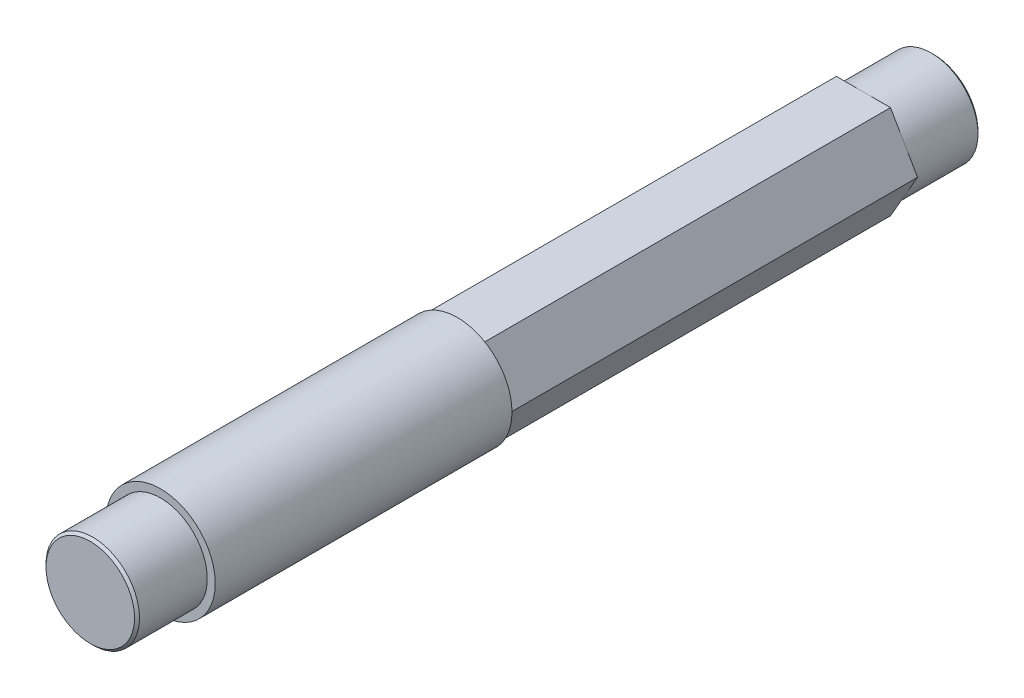
ISO-10303-21;
HEADER;
FILE_DESCRIPTION(('STEP AP214'),'2;1');
FILE_NAME('part.step','',(''),(''),'','','');
FILE_SCHEMA(('AUTOMOTIVE_DESIGN { 1 0 10303 214 1 1 1 1 }'));
ENDSEC;
DATA;
#1=APPLICATION_CONTEXT('core data for automotive mechanical design processes');
#2=APPLICATION_PROTOCOL_DEFINITION('international standard','automotive_design',2000,#1);
#3=PRODUCT_CONTEXT('',#1,'mechanical');
#4=PRODUCT('Part','Part','',(#3));
#5=PRODUCT_RELATED_PRODUCT_CATEGORY('part','',(#4));
#6=PRODUCT_DEFINITION_FORMATION('','',#4);
#7=PRODUCT_DEFINITION_CONTEXT('part definition',#1,'design');
#8=PRODUCT_DEFINITION('design','',#6,#7);
#9=PRODUCT_DEFINITION_SHAPE('','',#8);
#10=(LENGTH_UNIT() NAMED_UNIT(*) SI_UNIT(.MILLI.,.METRE.));
#11=(NAMED_UNIT(*) PLANE_ANGLE_UNIT() SI_UNIT($,.RADIAN.));
#12=(NAMED_UNIT(*) SI_UNIT($,.STERADIAN.) SOLID_ANGLE_UNIT());
#13=UNCERTAINTY_MEASURE_WITH_UNIT(LENGTH_MEASURE(1.E-05),#10,'distance_accuracy_value','');
#14=(GEOMETRIC_REPRESENTATION_CONTEXT(3) GLOBAL_UNCERTAINTY_ASSIGNED_CONTEXT((#13)) GLOBAL_UNIT_ASSIGNED_CONTEXT((#10,
#11,#12)) REPRESENTATION_CONTEXT('',''));
#15=CARTESIAN_POINT('',(0.,0.,0.));
#16=DIRECTION('',(0.,0.,1.));
#17=DIRECTION('',(1.,0.,0.));
#18=AXIS2_PLACEMENT_3D('',#15,#16,#17);
#19=CARTESIAN_POINT('',(0.,0.,-42.8625));
#20=DIRECTION('',(0.,0.,-1.));
#21=DIRECTION('',(-1.,0.,0.));
#22=AXIS2_PLACEMENT_3D('',#19,#20,#21);
#23=PLANE('',#22);
#24=CARTESIAN_POINT('',(0.,0.,-42.8625000000125));
#25=DIRECTION('',(0.,0.,1.));
#26=DIRECTION('',(1.,0.,0.));
#27=AXIS2_PLACEMENT_3D('',#24,#25,#26);
#28=CIRCLE('',#27,4.49980000001915);
#29=CARTESIAN_POINT('',(4.49980000001915,0.,-42.8625000000125));
#30=VERTEX_POINT('',#29);
#31=EDGE_CURVE('E20',#30,#30,#28,.T.);
#32=ORIENTED_EDGE('',*,*,#31,.F.);
#33=EDGE_LOOP('',(#32));
#34=FACE_BOUND('',#33,.T.);
#35=ADVANCED_FACE('F17',(#34),#23,.T.);
#36=CARTESIAN_POINT('',(0.,0.,-42.6125000000752));
#37=DIRECTION('',(0.,0.,1.));
#38=DIRECTION('',(1.,0.,0.));
#39=AXIS2_PLACEMENT_3D('',#36,#37,#38);
#40=CONICAL_SURFACE('',#39,4.74979999995639,0.785398163397448);
#41=CARTESIAN_POINT('',(0.,0.,-42.6125));
#42=DIRECTION('',(0.,0.,1.));
#43=DIRECTION('',(1.,0.,0.));
#44=AXIS2_PLACEMENT_3D('',#41,#42,#43);
#45=CIRCLE('',#44,4.7498);
#46=CARTESIAN_POINT('',(4.7498,0.,-42.6125));
#47=VERTEX_POINT('',#46);
#48=EDGE_CURVE('E102',#47,#47,#45,.T.);
#49=ORIENTED_EDGE('',*,*,#48,.F.);
#50=EDGE_LOOP('',(#49));
#51=FACE_BOUND('',#50,.T.);
#52=ORIENTED_EDGE('',*,*,#31,.T.);
#53=EDGE_LOOP('',(#52));
#54=FACE_BOUND('',#53,.T.);
#55=ADVANCED_FACE('F255',(#51,#54),#40,.T.);
#56=CARTESIAN_POINT('',(0.,0.,-42.8625));
#57=DIRECTION('',(0.,0.,1.));
#58=DIRECTION('',(1.,0.,0.));
#59=AXIS2_PLACEMENT_3D('',#56,#57,#58);
#60=CYLINDRICAL_SURFACE('',#59,4.7498);
#61=CARTESIAN_POINT('',(0.,0.,-35.71875));
#62=DIRECTION('',(0.,0.,1.));
#63=DIRECTION('',(1.,0.,0.));
#64=AXIS2_PLACEMENT_3D('',#61,#62,#63);
#65=CIRCLE('',#64,4.7498);
#66=CARTESIAN_POINT('',(4.7498,0.,-35.71875));
#67=VERTEX_POINT('',#66);
#68=EDGE_CURVE('E104',#67,#67,#65,.F.);
#69=ORIENTED_EDGE('',*,*,#68,.T.);
#70=EDGE_LOOP('',(#69));
#71=FACE_BOUND('',#70,.T.);
#72=ORIENTED_EDGE('',*,*,#48,.T.);
#73=EDGE_LOOP('',(#72));
#74=FACE_BOUND('',#73,.T.);
#75=ADVANCED_FACE('F116',(#71,#74),#60,.T.);
#76=CARTESIAN_POINT('',(0.,0.,42.8625));
#77=DIRECTION('',(0.,0.,1.));
#78=DIRECTION('',(1.,0.,0.));
#79=AXIS2_PLACEMENT_3D('',#76,#77,#78);
#80=PLANE('',#79);
#81=CARTESIAN_POINT('',(0.,0.,42.8625000000125));
#82=DIRECTION('',(0.,0.,-1.));
#83=DIRECTION('',(-1.,0.,0.));
#84=AXIS2_PLACEMENT_3D('',#81,#82,#83);
#85=CIRCLE('',#84,4.49980000001915);
#86=CARTESIAN_POINT('',(-4.49980000001915,0.,42.8625000000125));
#87=VERTEX_POINT('',#86);
#88=EDGE_CURVE('E80',#87,#87,#85,.T.);
#89=ORIENTED_EDGE('',*,*,#88,.F.);
#90=EDGE_LOOP('',(#89));
#91=FACE_BOUND('',#90,.T.);
#92=ADVANCED_FACE('F120',(#91),#80,.T.);
#93=CARTESIAN_POINT('',(0.,0.,-35.71875));
#94=DIRECTION('',(0.,0.,1.));
#95=DIRECTION('',(1.,0.,0.));
#96=AXIS2_PLACEMENT_3D('',#93,#94,#95);
#97=PLANE('',#96);
#98=DIRECTION('',(1.,0.,0.));
#99=VECTOR('',#98,1.);
#100=CARTESIAN_POINT('',(-2.7496306570156,-4.76250000000002,-35.71875));
#101=LINE('',#100,#99);
#102=CARTESIAN_POINT('',(2.74963065701558,-4.76250000000002,-35.71875));
#103=VERTEX_POINT('',#102);
#104=CARTESIAN_POINT('',(-2.7496306570156,-4.76250000000002,-35.71875));
#105=VERTEX_POINT('',#104);
#106=EDGE_CURVE('E76',#103,#105,#101,.F.);
#107=ORIENTED_EDGE('',*,*,#106,.T.);
#108=DIRECTION('',(-0.499999999999999,0.866025403784439,0.));
#109=VECTOR('',#108,1.);
#110=CARTESIAN_POINT('',(-5.49926131403121,0.,-35.71875));
#111=LINE('',#110,#109);
#112=CARTESIAN_POINT('',(-5.49926131403121,0.,-35.71875));
#113=VERTEX_POINT('',#112);
#114=EDGE_CURVE('E71',#105,#113,#111,.T.);
#115=ORIENTED_EDGE('',*,*,#114,.T.);
#116=DIRECTION('',(0.5,0.866025403784439,0.));
#117=VECTOR('',#116,1.);
#118=CARTESIAN_POINT('',(-2.7496306570156,4.76250000000003,-35.71875));
#119=LINE('',#118,#117);
#120=CARTESIAN_POINT('',(-2.7496306570156,4.76250000000003,-35.71875));
#121=VERTEX_POINT('',#120);
#122=EDGE_CURVE('E68',#113,#121,#119,.T.);
#123=ORIENTED_EDGE('',*,*,#122,.T.);
#124=DIRECTION('',(1.,0.,0.));
#125=VECTOR('',#124,1.);
#126=CARTESIAN_POINT('',(2.74963065701557,4.76250000000003,-35.71875));
#127=LINE('',#126,#125);
#128=CARTESIAN_POINT('',(2.74963065701557,4.76250000000003,-35.71875));
#129=VERTEX_POINT('',#128);
#130=EDGE_CURVE('E94',#121,#129,#127,.T.);
#131=ORIENTED_EDGE('',*,*,#130,.T.);
#132=DIRECTION('',(0.5,-0.866025403784439,0.));
#133=VECTOR('',#132,1.);
#134=CARTESIAN_POINT('',(5.49926131403118,0.,-35.71875));
#135=LINE('',#134,#133);
#136=CARTESIAN_POINT('',(5.49926131403118,0.,-35.71875));
#137=VERTEX_POINT('',#136);
#138=EDGE_CURVE('E286',#129,#137,#135,.T.);
#139=ORIENTED_EDGE('',*,*,#138,.T.);
#140=DIRECTION('',(-0.499999999999999,-0.866025403784439,0.));
#141=VECTOR('',#140,1.);
#142=CARTESIAN_POINT('',(2.74963065701558,-4.76250000000002,-35.71875));
#143=LINE('',#142,#141);
#144=EDGE_CURVE('E292',#137,#103,#143,.T.);
#145=ORIENTED_EDGE('',*,*,#144,.T.);
#146=EDGE_LOOP('',(#107,#115,#123,#131,#139,#145));
#147=FACE_BOUND('',#146,.T.);
#148=ORIENTED_EDGE('',*,*,#68,.F.);
#149=EDGE_LOOP('',(#148));
#150=FACE_BOUND('',#149,.T.);
#151=ADVANCED_FACE('F73',(#147,#150),#97,.F.);
#152=CARTESIAN_POINT('',(0.,0.,42.6125000000752));
#153=DIRECTION('',(0.,0.,-1.));
#154=DIRECTION('',(-1.,0.,0.));
#155=AXIS2_PLACEMENT_3D('',#152,#153,#154);
#156=CONICAL_SURFACE('',#155,4.74979999995639,0.785398163397448);
#157=CARTESIAN_POINT('',(0.,0.,42.6125));
#158=DIRECTION('',(0.,0.,-1.));
#159=DIRECTION('',(-1.,0.,0.));
#160=AXIS2_PLACEMENT_3D('',#157,#158,#159);
#161=CIRCLE('',#160,4.7498);
#162=CARTESIAN_POINT('',(-4.7498,0.,42.6125));
#163=VERTEX_POINT('',#162);
#164=EDGE_CURVE('E98',#163,#163,#161,.T.);
#165=ORIENTED_EDGE('',*,*,#164,.F.);
#166=EDGE_LOOP('',(#165));
#167=FACE_BOUND('',#166,.T.);
#168=ORIENTED_EDGE('',*,*,#88,.T.);
#169=EDGE_LOOP('',(#168));
#170=FACE_BOUND('',#169,.T.);
#171=ADVANCED_FACE('F119',(#167,#170),#156,.T.);
#172=CARTESIAN_POINT('',(-5.49926131403121,0.,35.71875));
#173=DIRECTION('',(0.866025403784439,0.499999999999999,0.));
#174=DIRECTION('',(-0.499999999999999,0.866025403784439,0.));
#175=AXIS2_PLACEMENT_3D('',#172,#173,#174);
#176=PLANE('',#175);
#177=DIRECTION('',(0.,0.,1.));
#178=VECTOR('',#177,1.);
#179=CARTESIAN_POINT('',(-5.49926131403121,0.,35.71875));
#180=LINE('',#179,#178);
#181=CARTESIAN_POINT('',(-5.49926131403121,0.,5.55625));
#182=VERTEX_POINT('',#181);
#183=EDGE_CURVE('E79',#182,#113,#180,.F.);
#184=ORIENTED_EDGE('',*,*,#183,.T.);
#185=ORIENTED_EDGE('',*,*,#114,.F.);
#186=DIRECTION('',(0.,0.,1.));
#187=VECTOR('',#186,1.);
#188=CARTESIAN_POINT('',(-2.7496306570156,-4.76250000000002,35.71875));
#189=LINE('',#188,#187);
#190=CARTESIAN_POINT('',(-2.7496306570156,-4.76250000000002,5.55625));
#191=VERTEX_POINT('',#190);
#192=EDGE_CURVE('E101',#105,#191,#189,.T.);
#193=ORIENTED_EDGE('',*,*,#192,.T.);
#194=DIRECTION('',(-0.5,0.866025403784439,0.));
#195=VECTOR('',#194,1.);
#196=CARTESIAN_POINT('',(-2.7496306570156,-4.76250000000002,5.55625));
#197=LINE('',#196,#195);
#198=EDGE_CURVE('E85',#191,#182,#197,.T.);
#199=ORIENTED_EDGE('',*,*,#198,.T.);
#200=EDGE_LOOP('',(#184,#185,#193,#199));
#201=FACE_BOUND('',#200,.T.);
#202=ADVANCED_FACE('F83',(#201),#176,.F.);
#203=CARTESIAN_POINT('',(-2.7496306570156,4.76250000000003,35.71875));
#204=DIRECTION('',(0.866025403784439,-0.5,0.));
#205=DIRECTION('',(0.5,0.866025403784439,0.));
#206=AXIS2_PLACEMENT_3D('',#203,#204,#205);
#207=PLANE('',#206);
#208=DIRECTION('',(0.,0.,-1.));
#209=VECTOR('',#208,1.);
#210=CARTESIAN_POINT('',(-2.7496306570156,4.76250000000003,35.71875));
#211=LINE('',#210,#209);
#212=CARTESIAN_POINT('',(-2.7496306570156,4.76250000000003,5.55625));
#213=VERTEX_POINT('',#212);
#214=EDGE_CURVE('E91',#213,#121,#211,.T.);
#215=ORIENTED_EDGE('',*,*,#214,.T.);
#216=ORIENTED_EDGE('',*,*,#122,.F.);
#217=ORIENTED_EDGE('',*,*,#183,.F.);
#218=DIRECTION('',(0.5,0.866025403784439,0.));
#219=VECTOR('',#218,1.);
#220=CARTESIAN_POINT('',(-5.49926131403121,0.,5.55625));
#221=LINE('',#220,#219);
#222=EDGE_CURVE('E301',#182,#213,#221,.T.);
#223=ORIENTED_EDGE('',*,*,#222,.T.);
#224=EDGE_LOOP('',(#215,#216,#217,#223));
#225=FACE_BOUND('',#224,.T.);
#226=ADVANCED_FACE('F89',(#225),#207,.F.);
#227=CARTESIAN_POINT('',(2.74963065701557,4.76250000000003,35.71875));
#228=DIRECTION('',(0.,-1.,0.));
#229=DIRECTION('',(0.,0.,-1.));
#230=AXIS2_PLACEMENT_3D('',#227,#228,#229);
#231=PLANE('',#230);
#232=DIRECTION('',(0.,0.,1.));
#233=VECTOR('',#232,1.);
#234=CARTESIAN_POINT('',(2.74963065701557,4.76250000000003,35.71875));
#235=LINE('',#234,#233);
#236=CARTESIAN_POINT('',(2.74963065701557,4.76250000000003,5.55625));
#237=VERTEX_POINT('',#236);
#238=EDGE_CURVE('E281',#237,#129,#235,.F.);
#239=ORIENTED_EDGE('',*,*,#238,.T.);
#240=ORIENTED_EDGE('',*,*,#130,.F.);
#241=ORIENTED_EDGE('',*,*,#214,.F.);
#242=DIRECTION('',(1.,0.,0.));
#243=VECTOR('',#242,1.);
#244=CARTESIAN_POINT('',(0.,4.76250000000003,5.55625));
#245=LINE('',#244,#243);
#246=EDGE_CURVE('E284',#213,#237,#245,.T.);
#247=ORIENTED_EDGE('',*,*,#246,.T.);
#248=EDGE_LOOP('',(#239,#240,#241,#247));
#249=FACE_BOUND('',#248,.T.);
#250=ADVANCED_FACE('F161',(#249),#231,.F.);
#251=CARTESIAN_POINT('',(5.49926131403118,0.,35.71875));
#252=DIRECTION('',(-0.866025403784439,-0.5,0.));
#253=DIRECTION('',(0.5,-0.866025403784439,0.));
#254=AXIS2_PLACEMENT_3D('',#251,#252,#253);
#255=PLANE('',#254);
#256=DIRECTION('',(0.,0.,1.));
#257=VECTOR('',#256,1.);
#258=CARTESIAN_POINT('',(5.49926131403118,0.,35.71875));
#259=LINE('',#258,#257);
#260=CARTESIAN_POINT('',(5.49926131403118,0.,5.55624999999999));
#261=VERTEX_POINT('',#260);
#262=EDGE_CURVE('E289',#261,#137,#259,.F.);
#263=ORIENTED_EDGE('',*,*,#262,.T.);
#264=ORIENTED_EDGE('',*,*,#138,.F.);
#265=ORIENTED_EDGE('',*,*,#238,.F.);
#266=DIRECTION('',(0.5,-0.866025403784439,0.));
#267=VECTOR('',#266,1.);
#268=CARTESIAN_POINT('',(2.74963065701557,4.76250000000003,5.55625));
#269=LINE('',#268,#267);
#270=EDGE_CURVE('E304',#237,#261,#269,.T.);
#271=ORIENTED_EDGE('',*,*,#270,.T.);
#272=EDGE_LOOP('',(#263,#264,#265,#271));
#273=FACE_BOUND('',#272,.T.);
#274=ADVANCED_FACE('F158',(#273),#255,.F.);
#275=CARTESIAN_POINT('',(2.74963065701558,-4.76250000000002,35.71875));
#276=DIRECTION('',(-0.866025403784439,0.499999999999999,0.));
#277=DIRECTION('',(-0.499999999999999,-0.866025403784439,0.));
#278=AXIS2_PLACEMENT_3D('',#275,#276,#277);
#279=PLANE('',#278);
#280=DIRECTION('',(0.,0.,1.));
#281=VECTOR('',#280,1.);
#282=CARTESIAN_POINT('',(2.74963065701558,-4.76250000000002,35.71875));
#283=LINE('',#282,#281);
#284=CARTESIAN_POINT('',(2.74963065701558,-4.76250000000002,5.55624999999999));
#285=VERTEX_POINT('',#284);
#286=EDGE_CURVE('E296',#285,#103,#283,.F.);
#287=ORIENTED_EDGE('',*,*,#286,.T.);
#288=ORIENTED_EDGE('',*,*,#144,.F.);
#289=ORIENTED_EDGE('',*,*,#262,.F.);
#290=DIRECTION('',(-0.499999999999999,-0.866025403784439,0.));
#291=VECTOR('',#290,1.);
#292=CARTESIAN_POINT('',(5.49926131403118,0.,5.55625));
#293=LINE('',#292,#291);
#294=EDGE_CURVE('E35',#261,#285,#293,.T.);
#295=ORIENTED_EDGE('',*,*,#294,.T.);
#296=EDGE_LOOP('',(#287,#288,#289,#295));
#297=FACE_BOUND('',#296,.T.);
#298=ADVANCED_FACE('F154',(#297),#279,.F.);
#299=CARTESIAN_POINT('',(-2.7496306570156,-4.76250000000002,35.71875));
#300=DIRECTION('',(0.,1.,0.));
#301=DIRECTION('',(0.,0.,1.));
#302=AXIS2_PLACEMENT_3D('',#299,#300,#301);
#303=PLANE('',#302);
#304=ORIENTED_EDGE('',*,*,#192,.F.);
#305=ORIENTED_EDGE('',*,*,#106,.F.);
#306=ORIENTED_EDGE('',*,*,#286,.F.);
#307=DIRECTION('',(1.,0.,0.));
#308=VECTOR('',#307,1.);
#309=CARTESIAN_POINT('',(0.,-4.76250000000002,5.55625));
#310=LINE('',#309,#308);
#311=EDGE_CURVE('E111',#285,#191,#310,.F.);
#312=ORIENTED_EDGE('',*,*,#311,.T.);
#313=EDGE_LOOP('',(#304,#305,#306,#312));
#314=FACE_BOUND('',#313,.T.);
#315=ADVANCED_FACE('F150',(#314),#303,.F.);
#316=CARTESIAN_POINT('',(0.,0.,42.8625));
#317=DIRECTION('',(0.,0.,-1.));
#318=DIRECTION('',(-1.,0.,0.));
#319=AXIS2_PLACEMENT_3D('',#316,#317,#318);
#320=CYLINDRICAL_SURFACE('',#319,4.7498);
#321=CARTESIAN_POINT('',(0.,0.,35.71875));
#322=DIRECTION('',(0.,0.,-1.));
#323=DIRECTION('',(-1.,0.,0.));
#324=AXIS2_PLACEMENT_3D('',#321,#322,#323);
#325=CIRCLE('',#324,4.7498);
#326=CARTESIAN_POINT('',(-4.7498,0.,35.71875));
#327=VERTEX_POINT('',#326);
#328=EDGE_CURVE('E108',#327,#327,#325,.T.);
#329=ORIENTED_EDGE('',*,*,#328,.F.);
#330=EDGE_LOOP('',(#329));
#331=FACE_BOUND('',#330,.T.);
#332=ORIENTED_EDGE('',*,*,#164,.T.);
#333=EDGE_LOOP('',(#332));
#334=FACE_BOUND('',#333,.T.);
#335=ADVANCED_FACE('F146',(#331,#334),#320,.T.);
#336=CARTESIAN_POINT('',(0.,0.,5.55625));
#337=DIRECTION('',(0.,0.,1.));
#338=DIRECTION('',(1.,0.,0.));
#339=AXIS2_PLACEMENT_3D('',#336,#337,#338);
#340=PLANE('',#339);
#341=ORIENTED_EDGE('',*,*,#294,.F.);
#342=ORIENTED_EDGE('',*,*,#270,.F.);
#343=ORIENTED_EDGE('',*,*,#246,.F.);
#344=ORIENTED_EDGE('',*,*,#222,.F.);
#345=ORIENTED_EDGE('',*,*,#198,.F.);
#346=ORIENTED_EDGE('',*,*,#311,.F.);
#347=EDGE_LOOP('',(#341,#342,#343,#344,#345,#346));
#348=FACE_BOUND('',#347,.T.);
#349=CARTESIAN_POINT('',(0.,0.,5.55625));
#350=DIRECTION('',(0.,0.,1.));
#351=DIRECTION('',(1.,0.,0.));
#352=AXIS2_PLACEMENT_3D('',#349,#350,#351);
#353=CIRCLE('',#352,5.55625);
#354=CARTESIAN_POINT('',(5.55625,0.,5.55625));
#355=VERTEX_POINT('',#354);
#356=EDGE_CURVE('E26',#355,#355,#353,.T.);
#357=ORIENTED_EDGE('',*,*,#356,.F.);
#358=EDGE_LOOP('',(#357));
#359=FACE_BOUND('',#358,.T.);
#360=ADVANCED_FACE('F139',(#348,#359),#340,.F.);
#361=CARTESIAN_POINT('',(0.,0.,35.71875));
#362=DIRECTION('',(0.,0.,1.));
#363=DIRECTION('',(1.,0.,0.));
#364=AXIS2_PLACEMENT_3D('',#361,#362,#363);
#365=PLANE('',#364);
#366=CARTESIAN_POINT('',(0.,0.,35.71875));
#367=DIRECTION('',(0.,0.,1.));
#368=DIRECTION('',(1.,0.,0.));
#369=AXIS2_PLACEMENT_3D('',#366,#367,#368);
#370=CIRCLE('',#369,5.55625);
#371=CARTESIAN_POINT('',(5.55625,0.,35.71875));
#372=VERTEX_POINT('',#371);
#373=EDGE_CURVE('E11',#372,#372,#370,.F.);
#374=ORIENTED_EDGE('',*,*,#373,.F.);
#375=EDGE_LOOP('',(#374));
#376=FACE_BOUND('',#375,.T.);
#377=ORIENTED_EDGE('',*,*,#328,.T.);
#378=EDGE_LOOP('',(#377));
#379=FACE_BOUND('',#378,.T.);
#380=ADVANCED_FACE('F133',(#376,#379),#365,.T.);
#381=CARTESIAN_POINT('',(0.,0.,5.55625));
#382=DIRECTION('',(0.,0.,1.));
#383=DIRECTION('',(1.,0.,0.));
#384=AXIS2_PLACEMENT_3D('',#381,#382,#383);
#385=CYLINDRICAL_SURFACE('',#384,5.55625);
#386=ORIENTED_EDGE('',*,*,#373,.T.);
#387=EDGE_LOOP('',(#386));
#388=FACE_BOUND('',#387,.T.);
#389=ORIENTED_EDGE('',*,*,#356,.T.);
#390=EDGE_LOOP('',(#389));
#391=FACE_BOUND('',#390,.T.);
#392=ADVANCED_FACE('F131',(#388,#391),#385,.T.);
#393=CLOSED_SHELL('',(#35,#55,#75,#92,#151,#171,#202,#226,#250,#274,#298,#315,#335,#360,#380,#392));
#394=MANIFOLD_SOLID_BREP('B1',#393);
#395=ADVANCED_BREP_SHAPE_REPRESENTATION('',(#18,#394),#14);
#396=SHAPE_DEFINITION_REPRESENTATION(#9,#395);
ENDSEC;
END-ISO-10303-21;
